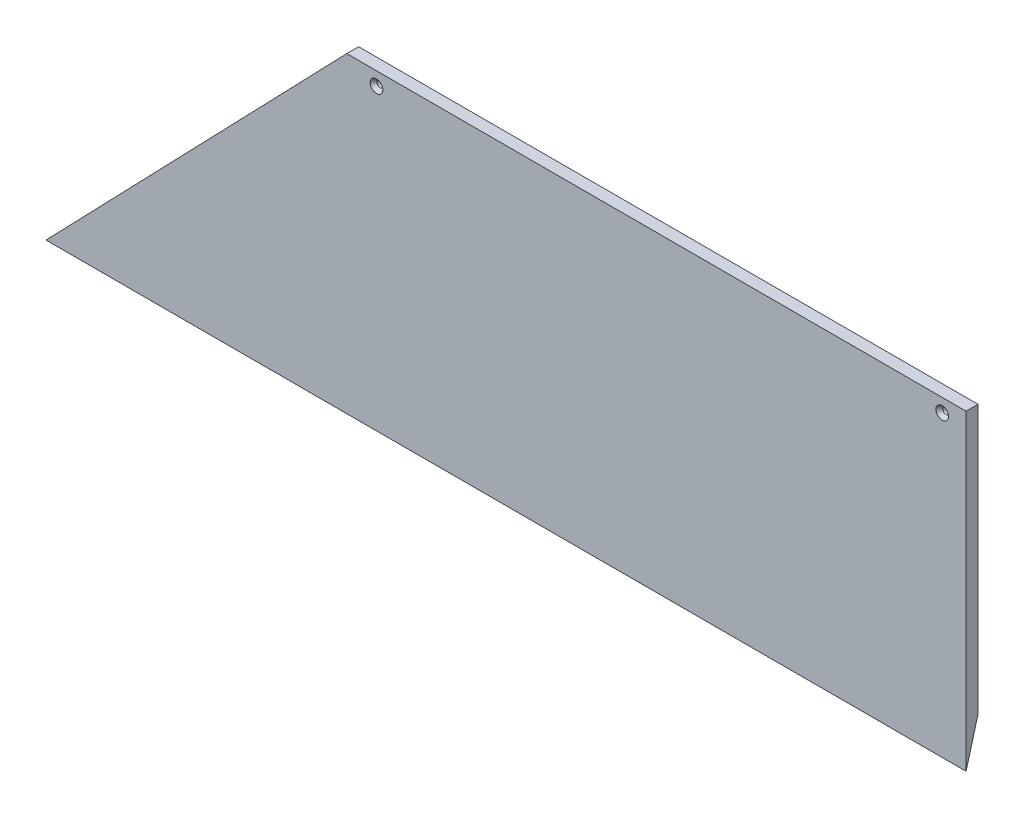
ISO-10303-21;
HEADER;
FILE_DESCRIPTION(('STEP AP214'),'2;1');
FILE_NAME('part.step','',(''),(''),'','','');
FILE_SCHEMA(('AUTOMOTIVE_DESIGN { 1 0 10303 214 1 1 1 1 }'));
ENDSEC;
DATA;
#1=APPLICATION_CONTEXT('core data for automotive mechanical design processes');
#2=APPLICATION_PROTOCOL_DEFINITION('international standard','automotive_design',2000,#1);
#3=PRODUCT_CONTEXT('',#1,'mechanical');
#4=PRODUCT('Part','Part','',(#3));
#5=PRODUCT_RELATED_PRODUCT_CATEGORY('part','',(#4));
#6=PRODUCT_DEFINITION_FORMATION('','',#4);
#7=PRODUCT_DEFINITION_CONTEXT('part definition',#1,'design');
#8=PRODUCT_DEFINITION('design','',#6,#7);
#9=PRODUCT_DEFINITION_SHAPE('','',#8);
#10=(LENGTH_UNIT() NAMED_UNIT(*) SI_UNIT(.MILLI.,.METRE.));
#11=(NAMED_UNIT(*) PLANE_ANGLE_UNIT() SI_UNIT($,.RADIAN.));
#12=(NAMED_UNIT(*) SI_UNIT($,.STERADIAN.) SOLID_ANGLE_UNIT());
#13=UNCERTAINTY_MEASURE_WITH_UNIT(LENGTH_MEASURE(1.E-05),#10,'distance_accuracy_value','');
#14=(GEOMETRIC_REPRESENTATION_CONTEXT(3) GLOBAL_UNCERTAINTY_ASSIGNED_CONTEXT((#13)) GLOBAL_UNIT_ASSIGNED_CONTEXT((#10,
#11,#12)) REPRESENTATION_CONTEXT('',''));
#15=CARTESIAN_POINT('',(0.,0.,0.));
#16=DIRECTION('',(0.,0.,1.));
#17=DIRECTION('',(1.,0.,0.));
#18=AXIS2_PLACEMENT_3D('',#15,#16,#17);
#19=CARTESIAN_POINT('',(-820.588283229593,650.830336129829,0.));
#20=DIRECTION('',(0.,0.,1.));
#21=DIRECTION('',(1.,0.,0.));
#22=AXIS2_PLACEMENT_3D('',#19,#20,#21);
#23=PLANE('',#22);
#24=CARTESIAN_POINT('',(-685.684270001134,297.590703897091,0.));
#25=DIRECTION('',(0.,0.,1.));
#26=DIRECTION('',(0.,-1.,0.));
#27=AXIS2_PLACEMENT_3D('',#24,#25,#26);
#28=CIRCLE('',#27,3.37820000000005);
#29=CARTESIAN_POINT('',(-685.684270001134,294.212503897091,0.));
#30=VERTEX_POINT('',#29);
#31=EDGE_CURVE('E46',#30,#30,#28,.F.);
#32=ORIENTED_EDGE('',*,*,#31,.F.);
#33=EDGE_LOOP('',(#32));
#34=FACE_BOUND('',#33,.T.);
#35=CARTESIAN_POINT('',(-1288.81854000227,297.590703897091,0.));
#36=DIRECTION('',(0.,0.,1.));
#37=DIRECTION('',(0.,-1.,0.));
#38=AXIS2_PLACEMENT_3D('',#35,#36,#37);
#39=CIRCLE('',#38,3.37820000000005);
#40=CARTESIAN_POINT('',(-1288.81854000227,294.212503897091,0.));
#41=VERTEX_POINT('',#40);
#42=EDGE_CURVE('E131',#41,#41,#39,.F.);
#43=ORIENTED_EDGE('',*,*,#42,.F.);
#44=EDGE_LOOP('',(#43));
#45=FACE_BOUND('',#44,.T.);
#46=DIRECTION('',(1.,0.,0.));
#47=VECTOR('',#46,1.);
#48=CARTESIAN_POINT('',(-820.588283229593,25.6740325966925,0.));
#49=LINE('',#48,#47);
#50=CARTESIAN_POINT('',(-1596.56270603019,25.6740325966925,0.));
#51=VERTEX_POINT('',#50);
#52=CARTESIAN_POINT('',(-660.284270001134,25.6740325966925,0.));
#53=VERTEX_POINT('',#52);
#54=EDGE_CURVE('E106',#51,#53,#49,.T.);
#55=ORIENTED_EDGE('',*,*,#54,.F.);
#56=DIRECTION('',(-0.694150652110275,-0.719829752215674,0.));
#57=VECTOR('',#56,1.);
#58=CARTESIAN_POINT('',(-1480.87255323073,145.643975389749,-1.83880688453542E-13));
#59=LINE('',#58,#57);
#60=CARTESIAN_POINT('',(-1320.56854000227,311.878203897091,-1.94289029309402E-13));
#61=VERTEX_POINT('',#60);
#62=EDGE_CURVE('E52',#61,#51,#59,.T.);
#63=ORIENTED_EDGE('',*,*,#62,.F.);
#64=DIRECTION('',(1.,0.,0.));
#65=VECTOR('',#64,1.);
#66=CARTESIAN_POINT('',(-990.4264050017,311.878203897091,-2.08166817117217E-13));
#67=LINE('',#66,#65);
#68=CARTESIAN_POINT('',(-660.284270001134,311.878203897091,-2.22044604925031E-13));
#69=VERTEX_POINT('',#68);
#70=EDGE_CURVE('E130',#61,#69,#67,.T.);
#71=ORIENTED_EDGE('',*,*,#70,.T.);
#72=DIRECTION('',(0.,-1.,0.));
#73=VECTOR('',#72,1.);
#74=CARTESIAN_POINT('',(-660.284270001134,145.643975389749,-1.52655665885959E-13));
#75=LINE('',#74,#73);
#76=EDGE_CURVE('E157',#69,#53,#75,.T.);
#77=ORIENTED_EDGE('',*,*,#76,.T.);
#78=EDGE_LOOP('',(#55,#63,#71,#77));
#79=FACE_BOUND('',#78,.T.);
#80=ADVANCED_FACE('F42',(#34,#45,#79),#23,.F.);
#81=CARTESIAN_POINT('',(-660.284270001134,145.643975389749,12.7019999999998));
#82=DIRECTION('',(1.,0.,0.));
#83=DIRECTION('',(0.,-0.26471698178117,-0.964326147917118));
#84=AXIS2_PLACEMENT_3D('',#81,#82,#83);
#85=PLANE('',#84);
#86=DIRECTION('',(0.,-1.,0.));
#87=VECTOR('',#86,1.);
#88=CARTESIAN_POINT('',(-660.284270001134,145.643975389749,12.6999999999999));
#89=LINE('',#88,#87);
#90=CARTESIAN_POINT('',(-660.284270001134,311.878203897091,12.6999999999998));
#91=VERTEX_POINT('',#90);
#92=CARTESIAN_POINT('',(-660.284270001134,-20.5902531175931,12.6999999999999));
#93=VERTEX_POINT('',#92);
#94=EDGE_CURVE('E112',#91,#93,#89,.T.);
#95=ORIENTED_EDGE('',*,*,#94,.T.);
#96=DIRECTION('',(0.,0.964326147917118,-0.26471698178117));
#97=VECTOR('',#96,1.);
#98=CARTESIAN_POINT('',(-660.284270001134,133.994587907647,-29.7350543990856));
#99=LINE('',#98,#97);
#100=EDGE_CURVE('E99',#93,#53,#99,.T.);
#101=ORIENTED_EDGE('',*,*,#100,.T.);
#102=ORIENTED_EDGE('',*,*,#76,.F.);
#103=DIRECTION('',(0.,0.,-1.));
#104=VECTOR('',#103,1.);
#105=CARTESIAN_POINT('',(-660.284270001134,311.878203897091,12.7019999999998));
#106=LINE('',#105,#104);
#107=EDGE_CURVE('E64',#91,#69,#106,.T.);
#108=ORIENTED_EDGE('',*,*,#107,.F.);
#109=EDGE_LOOP('',(#95,#101,#102,#108));
#110=FACE_BOUND('',#109,.T.);
#111=ADVANCED_FACE('F113',(#110),#85,.T.);
#112=CARTESIAN_POINT('',(-1480.87255323073,145.643975389749,12.7019999999998));
#113=DIRECTION('',(0.719829752215675,-0.694150652110276,0.));
#114=DIRECTION('',(0.680983159335232,0.706175147076652,-0.193852001158297));
#115=AXIS2_PLACEMENT_3D('',#112,#113,#114);
#116=PLANE('',#115);
#117=DIRECTION('',(0.680983159335232,0.706175147076652,-0.193852001158297));
#118=VECTOR('',#117,1.);
#119=CARTESIAN_POINT('',(-1486.89681737812,139.396852297207,-31.2180289373962));
#120=LINE('',#119,#118);
#121=CARTESIAN_POINT('',(-1641.17656645918,-20.5902531175932,12.7));
#122=VERTEX_POINT('',#121);
#123=EDGE_CURVE('E11',#122,#51,#120,.T.);
#124=ORIENTED_EDGE('',*,*,#123,.F.);
#125=DIRECTION('',(-0.694150652110275,-0.719829752215674,0.));
#126=VECTOR('',#125,1.);
#127=CARTESIAN_POINT('',(-1480.87255323073,145.643975389749,12.6999999999999));
#128=LINE('',#127,#126);
#129=CARTESIAN_POINT('',(-1320.56854000227,311.878203897091,12.6999999999999));
#130=VERTEX_POINT('',#129);
#131=EDGE_CURVE('E117',#130,#122,#128,.T.);
#132=ORIENTED_EDGE('',*,*,#131,.F.);
#133=DIRECTION('',(0.,0.,-1.));
#134=VECTOR('',#133,1.);
#135=CARTESIAN_POINT('',(-1320.56854000227,311.878203897091,12.7019999999998));
#136=LINE('',#135,#134);
#137=EDGE_CURVE('E73',#130,#61,#136,.T.);
#138=ORIENTED_EDGE('',*,*,#137,.T.);
#139=ORIENTED_EDGE('',*,*,#62,.T.);
#140=EDGE_LOOP('',(#124,#132,#138,#139));
#141=FACE_BOUND('',#140,.T.);
#142=ADVANCED_FACE('F163',(#141),#116,.F.);
#143=CARTESIAN_POINT('',(2.2017586356362E-13,315.240109565712,12.6999999999998));
#144=DIRECTION('',(0.,0.,1.));
#145=DIRECTION('',(-1.,0.,0.));
#146=AXIS2_PLACEMENT_3D('',#143,#144,#145);
#147=PLANE('',#146);
#148=CARTESIAN_POINT('',(-685.684270001134,297.590703897091,12.7000000000005));
#149=DIRECTION('',(0.,0.,1.));
#150=DIRECTION('',(0.,-1.,0.));
#151=AXIS2_PLACEMENT_3D('',#148,#149,#150);
#152=CIRCLE('',#151,6.74370000000013);
#153=CARTESIAN_POINT('',(-685.684270001134,290.847003897091,12.7000000000005));
#154=VERTEX_POINT('',#153);
#155=EDGE_CURVE('E209',#154,#154,#152,.T.);
#156=ORIENTED_EDGE('',*,*,#155,.F.);
#157=EDGE_LOOP('',(#156));
#158=FACE_BOUND('',#157,.T.);
#159=CARTESIAN_POINT('',(-1288.81854000227,297.590703897091,12.7000000000005));
#160=DIRECTION('',(0.,0.,1.));
#161=DIRECTION('',(0.,-1.,0.));
#162=AXIS2_PLACEMENT_3D('',#159,#160,#161);
#163=CIRCLE('',#162,6.74369999999991);
#164=CARTESIAN_POINT('',(-1288.81854000227,290.847003897091,12.7000000000005));
#165=VERTEX_POINT('',#164);
#166=EDGE_CURVE('E144',#165,#165,#163,.T.);
#167=ORIENTED_EDGE('',*,*,#166,.F.);
#168=EDGE_LOOP('',(#167));
#169=FACE_BOUND('',#168,.T.);
#170=DIRECTION('',(1.,0.,0.));
#171=VECTOR('',#170,1.);
#172=CARTESIAN_POINT('',(-990.4264050017,311.878203897091,12.6999999999999));
#173=LINE('',#172,#171);
#174=EDGE_CURVE('E116',#130,#91,#173,.T.);
#175=ORIENTED_EDGE('',*,*,#174,.F.);
#176=ORIENTED_EDGE('',*,*,#131,.T.);
#177=DIRECTION('',(1.,0.,0.));
#178=VECTOR('',#177,1.);
#179=CARTESIAN_POINT('',(-1150.73041823016,-20.5902531175931,12.6999999999999));
#180=LINE('',#179,#178);
#181=EDGE_CURVE('E103',#122,#93,#180,.T.);
#182=ORIENTED_EDGE('',*,*,#181,.T.);
#183=ORIENTED_EDGE('',*,*,#94,.F.);
#184=EDGE_LOOP('',(#175,#176,#182,#183));
#185=FACE_BOUND('',#184,.T.);
#186=ADVANCED_FACE('F120',(#158,#169,#185),#147,.T.);
#187=CARTESIAN_POINT('',(-990.4264050017,311.878203897091,12.7019999999998));
#188=DIRECTION('',(0.,1.,0.));
#189=DIRECTION('',(0.,0.,1.));
#190=AXIS2_PLACEMENT_3D('',#187,#188,#189);
#191=PLANE('',#190);
#192=ORIENTED_EDGE('',*,*,#137,.F.);
#193=ORIENTED_EDGE('',*,*,#174,.T.);
#194=ORIENTED_EDGE('',*,*,#107,.T.);
#195=ORIENTED_EDGE('',*,*,#70,.F.);
#196=EDGE_LOOP('',(#192,#193,#194,#195));
#197=FACE_BOUND('',#196,.T.);
#198=ADVANCED_FACE('F44',(#197),#191,.T.);
#199=CARTESIAN_POINT('',(2.13127923513117E-13,640.744619123967,-168.842906105527));
#200=DIRECTION('',(0.,-0.26471698178117,-0.964326147917118));
#201=DIRECTION('',(1.,0.,0.));
#202=AXIS2_PLACEMENT_3D('',#199,#200,#201);
#203=PLANE('',#202);
#204=ORIENTED_EDGE('',*,*,#181,.F.);
#205=ORIENTED_EDGE('',*,*,#123,.T.);
#206=ORIENTED_EDGE('',*,*,#54,.T.);
#207=ORIENTED_EDGE('',*,*,#100,.F.);
#208=EDGE_LOOP('',(#204,#205,#206,#207));
#209=FACE_BOUND('',#208,.T.);
#210=ADVANCED_FACE('F101',(#209),#203,.T.);
#211=CARTESIAN_POINT('',(-1288.81854000227,297.590703897088,-3553.21699062703));
#212=DIRECTION('',(0.,0.,1.));
#213=DIRECTION('',(0.,-1.,0.));
#214=AXIS2_PLACEMENT_3D('',#211,#212,#213);
#215=CYLINDRICAL_SURFACE('',#214,3.37820000000005);
#216=CARTESIAN_POINT('',(-1288.81854000227,297.590703897091,8.82843512549783));
#217=DIRECTION('',(0.,0.,1.));
#218=DIRECTION('',(0.,-1.,0.));
#219=AXIS2_PLACEMENT_3D('',#216,#217,#218);
#220=CIRCLE('',#219,3.37820000000011);
#221=CARTESIAN_POINT('',(-1288.81854000227,294.212503897091,8.82843512549783));
#222=VERTEX_POINT('',#221);
#223=EDGE_CURVE('E134',#222,#222,#220,.T.);
#224=ORIENTED_EDGE('',*,*,#223,.T.);
#225=EDGE_LOOP('',(#224));
#226=FACE_BOUND('',#225,.T.);
#227=ORIENTED_EDGE('',*,*,#42,.T.);
#228=EDGE_LOOP('',(#227));
#229=FACE_BOUND('',#228,.T.);
#230=ADVANCED_FACE('F186',(#226,#229),#215,.F.);
#231=CARTESIAN_POINT('',(-1288.81854000227,297.590703897091,8.82843512549783));
#232=DIRECTION('',(0.,0.,1.));
#233=DIRECTION('',(0.,-1.,0.));
#234=AXIS2_PLACEMENT_3D('',#231,#232,#233);
#235=CONICAL_SURFACE('',#234,3.3782,0.715584993317624);
#236=ORIENTED_EDGE('',*,*,#166,.T.);
#237=EDGE_LOOP('',(#236));
#238=FACE_BOUND('',#237,.T.);
#239=ORIENTED_EDGE('',*,*,#223,.F.);
#240=EDGE_LOOP('',(#239));
#241=FACE_BOUND('',#240,.T.);
#242=ADVANCED_FACE('F190',(#238,#241),#235,.F.);
#243=CARTESIAN_POINT('',(-685.684270001134,297.590703897088,-3553.21699062703));
#244=DIRECTION('',(0.,0.,1.));
#245=DIRECTION('',(0.,-1.,0.));
#246=AXIS2_PLACEMENT_3D('',#243,#244,#245);
#247=CYLINDRICAL_SURFACE('',#246,3.37820000000005);
#248=CARTESIAN_POINT('',(-685.684270001134,297.590703897091,8.8284351254978));
#249=DIRECTION('',(0.,0.,1.));
#250=DIRECTION('',(0.,-1.,0.));
#251=AXIS2_PLACEMENT_3D('',#248,#249,#250);
#252=CIRCLE('',#251,3.37820000000011);
#253=CARTESIAN_POINT('',(-685.684270001134,294.212503897091,8.8284351254978));
#254=VERTEX_POINT('',#253);
#255=EDGE_CURVE('E212',#254,#254,#252,.T.);
#256=ORIENTED_EDGE('',*,*,#255,.T.);
#257=EDGE_LOOP('',(#256));
#258=FACE_BOUND('',#257,.T.);
#259=ORIENTED_EDGE('',*,*,#31,.T.);
#260=EDGE_LOOP('',(#259));
#261=FACE_BOUND('',#260,.T.);
#262=ADVANCED_FACE('F194',(#258,#261),#247,.F.);
#263=CARTESIAN_POINT('',(-685.684270001134,297.590703897091,8.8284351254978));
#264=DIRECTION('',(0.,0.,1.));
#265=DIRECTION('',(0.,-1.,0.));
#266=AXIS2_PLACEMENT_3D('',#263,#264,#265);
#267=CONICAL_SURFACE('',#266,3.3782,0.715584993317658);
#268=ORIENTED_EDGE('',*,*,#155,.T.);
#269=EDGE_LOOP('',(#268));
#270=FACE_BOUND('',#269,.T.);
#271=ORIENTED_EDGE('',*,*,#255,.F.);
#272=EDGE_LOOP('',(#271));
#273=FACE_BOUND('',#272,.T.);
#274=ADVANCED_FACE('F200',(#270,#273),#267,.F.);
#275=CLOSED_SHELL('',(#80,#111,#142,#186,#198,#210,#230,#242,#262,#274));
#276=MANIFOLD_SOLID_BREP('B2',#275);
#277=ADVANCED_BREP_SHAPE_REPRESENTATION('',(#18,#276),#14);
#278=SHAPE_DEFINITION_REPRESENTATION(#9,#277);
ENDSEC;
END-ISO-10303-21;
